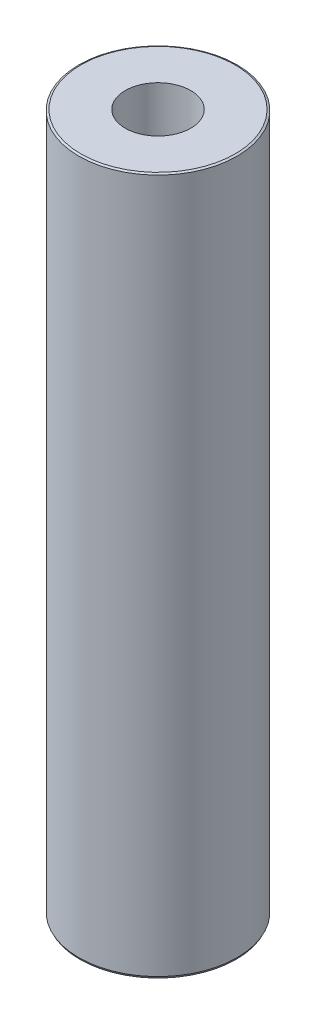
ISO-10303-21;
HEADER;
FILE_DESCRIPTION(('STEP AP214'),'2;1');
FILE_NAME('part.step','',(''),(''),'','','');
FILE_SCHEMA(('AUTOMOTIVE_DESIGN { 1 0 10303 214 1 1 1 1 }'));
ENDSEC;
DATA;
#1=APPLICATION_CONTEXT('core data for automotive mechanical design processes');
#2=APPLICATION_PROTOCOL_DEFINITION('international standard','automotive_design',2000,#1);
#3=PRODUCT_CONTEXT('',#1,'mechanical');
#4=PRODUCT('Part','Part','',(#3));
#5=PRODUCT_RELATED_PRODUCT_CATEGORY('part','',(#4));
#6=PRODUCT_DEFINITION_FORMATION('','',#4);
#7=PRODUCT_DEFINITION_CONTEXT('part definition',#1,'design');
#8=PRODUCT_DEFINITION('design','',#6,#7);
#9=PRODUCT_DEFINITION_SHAPE('','',#8);
#10=(LENGTH_UNIT() NAMED_UNIT(*) SI_UNIT(.MILLI.,.METRE.));
#11=(NAMED_UNIT(*) PLANE_ANGLE_UNIT() SI_UNIT($,.RADIAN.));
#12=(NAMED_UNIT(*) SI_UNIT($,.STERADIAN.) SOLID_ANGLE_UNIT());
#13=UNCERTAINTY_MEASURE_WITH_UNIT(LENGTH_MEASURE(1.E-05),#10,'distance_accuracy_value','');
#14=(GEOMETRIC_REPRESENTATION_CONTEXT(3) GLOBAL_UNCERTAINTY_ASSIGNED_CONTEXT((#13)) GLOBAL_UNIT_ASSIGNED_CONTEXT((#10,
#11,#12)) REPRESENTATION_CONTEXT('',''));
#15=CARTESIAN_POINT('',(0.,0.,0.));
#16=DIRECTION('',(0.,0.,1.));
#17=DIRECTION('',(1.,0.,0.));
#18=AXIS2_PLACEMENT_3D('',#15,#16,#17);
#19=CARTESIAN_POINT('',(0.,396.360686705342,0.));
#20=DIRECTION('',(0.,-1.,0.));
#21=DIRECTION('',(0.,0.,-1.));
#22=AXIS2_PLACEMENT_3D('',#19,#20,#21);
#23=CYLINDRICAL_SURFACE('',#22,45.);
#24=CARTESIAN_POINT('',(0.,395.807132410123,0.));
#25=DIRECTION('',(0.,1.,0.));
#26=DIRECTION('',(0.,0.,1.));
#27=AXIS2_PLACEMENT_3D('',#24,#25,#26);
#28=CIRCLE('',#27,45.);
#29=CARTESIAN_POINT('',(0.,395.807132410123,45.));
#30=VERTEX_POINT('',#29);
#31=EDGE_CURVE('E50',#30,#30,#28,.F.);
#32=ORIENTED_EDGE('',*,*,#31,.T.);
#33=EDGE_LOOP('',(#32));
#34=FACE_BOUND('',#33,.T.);
#35=CARTESIAN_POINT('',(0.,1.13423565675758,0.));
#36=DIRECTION('',(0.,1.,0.));
#37=DIRECTION('',(0.,0.,1.));
#38=AXIS2_PLACEMENT_3D('',#35,#36,#37);
#39=CIRCLE('',#38,45.);
#40=CARTESIAN_POINT('',(0.,1.13423565675758,45.));
#41=VERTEX_POINT('',#40);
#42=EDGE_CURVE('E51',#41,#41,#39,.T.);
#43=ORIENTED_EDGE('',*,*,#42,.T.);
#44=EDGE_LOOP('',(#43));
#45=FACE_BOUND('',#44,.T.);
#46=ADVANCED_FACE('F39',(#34,#45),#23,.T.);
#47=CARTESIAN_POINT('',(0.,396.360686705342,0.));
#48=DIRECTION('',(0.,1.,0.));
#49=DIRECTION('',(0.,0.,1.));
#50=AXIS2_PLACEMENT_3D('',#47,#48,#49);
#51=PLANE('',#50);
#52=CARTESIAN_POINT('',(0.,396.360686705342,0.));
#53=DIRECTION('',(0.,1.,0.));
#54=DIRECTION('',(0.,0.,1.));
#55=AXIS2_PLACEMENT_3D('',#52,#53,#54);
#56=CIRCLE('',#55,43.8657643432423);
#57=CARTESIAN_POINT('',(0.,396.360686705342,43.8657643432423));
#58=VERTEX_POINT('',#57);
#59=EDGE_CURVE('E54',#58,#58,#56,.T.);
#60=ORIENTED_EDGE('',*,*,#59,.T.);
#61=EDGE_LOOP('',(#60));
#62=FACE_BOUND('',#61,.T.);
#63=CARTESIAN_POINT('',(0.,396.360686705342,0.));
#64=DIRECTION('',(0.,1.,0.));
#65=DIRECTION('',(0.,0.,1.));
#66=AXIS2_PLACEMENT_3D('',#63,#64,#65);
#67=CIRCLE('',#66,18.6029027035076);
#68=CARTESIAN_POINT('',(0.,396.360686705342,18.6029027035076));
#69=VERTEX_POINT('',#68);
#70=EDGE_CURVE('E58',#69,#69,#67,.T.);
#71=ORIENTED_EDGE('',*,*,#70,.F.);
#72=EDGE_LOOP('',(#71));
#73=FACE_BOUND('',#72,.T.);
#74=ADVANCED_FACE('F69',(#62,#73),#51,.T.);
#75=CARTESIAN_POINT('',(0.,0.,0.));
#76=DIRECTION('',(0.,1.,0.));
#77=DIRECTION('',(0.,0.,1.));
#78=AXIS2_PLACEMENT_3D('',#75,#76,#77);
#79=PLANE('',#78);
#80=CARTESIAN_POINT('',(0.,0.,0.));
#81=DIRECTION('',(0.,1.,0.));
#82=DIRECTION('',(0.,0.,1.));
#83=AXIS2_PLACEMENT_3D('',#80,#81,#82);
#84=CIRCLE('',#83,44.4464457047809);
#85=CARTESIAN_POINT('',(0.,0.,44.4464457047809));
#86=VERTEX_POINT('',#85);
#87=EDGE_CURVE('E10',#86,#86,#84,.F.);
#88=ORIENTED_EDGE('',*,*,#87,.T.);
#89=EDGE_LOOP('',(#88));
#90=FACE_BOUND('',#89,.T.);
#91=CARTESIAN_POINT('',(0.,0.,0.));
#92=DIRECTION('',(0.,1.,0.));
#93=DIRECTION('',(0.,0.,1.));
#94=AXIS2_PLACEMENT_3D('',#91,#92,#93);
#95=CIRCLE('',#94,18.6029027035076);
#96=CARTESIAN_POINT('',(0.,0.,18.6029027035076));
#97=VERTEX_POINT('',#96);
#98=EDGE_CURVE('E63',#97,#97,#95,.T.);
#99=ORIENTED_EDGE('',*,*,#98,.T.);
#100=EDGE_LOOP('',(#99));
#101=FACE_BOUND('',#100,.T.);
#102=ADVANCED_FACE('F75',(#90,#101),#79,.F.);
#103=CARTESIAN_POINT('',(0.,396.360686705342,0.));
#104=DIRECTION('',(0.,-1.,0.));
#105=DIRECTION('',(0.,0.,-1.));
#106=AXIS2_PLACEMENT_3D('',#103,#104,#105);
#107=CYLINDRICAL_SURFACE('',#106,18.6029027035076);
#108=ORIENTED_EDGE('',*,*,#70,.T.);
#109=EDGE_LOOP('',(#108));
#110=FACE_BOUND('',#109,.T.);
#111=ORIENTED_EDGE('',*,*,#98,.F.);
#112=EDGE_LOOP('',(#111));
#113=FACE_BOUND('',#112,.T.);
#114=ADVANCED_FACE('F70',(#110,#113),#107,.F.);
#115=CARTESIAN_POINT('',(0.,396.360686705342,0.));
#116=DIRECTION('',(0.,-1.,0.));
#117=DIRECTION('',(0.,0.,-1.));
#118=AXIS2_PLACEMENT_3D('',#115,#116,#117);
#119=CONICAL_SURFACE('',#118,43.8657643432423,1.11676104404137);
#120=ORIENTED_EDGE('',*,*,#31,.F.);
#121=EDGE_LOOP('',(#120));
#122=FACE_BOUND('',#121,.T.);
#123=ORIENTED_EDGE('',*,*,#59,.F.);
#124=EDGE_LOOP('',(#123));
#125=FACE_BOUND('',#124,.T.);
#126=ADVANCED_FACE('F81',(#122,#125),#119,.T.);
#127=CARTESIAN_POINT('',(0.,1.13423565675758,0.));
#128=DIRECTION('',(0.,1.,0.));
#129=DIRECTION('',(0.,0.,1.));
#130=AXIS2_PLACEMENT_3D('',#127,#128,#129);
#131=CONICAL_SURFACE('',#130,45.,0.454035282753512);
#132=ORIENTED_EDGE('',*,*,#87,.F.);
#133=EDGE_LOOP('',(#132));
#134=FACE_BOUND('',#133,.T.);
#135=ORIENTED_EDGE('',*,*,#42,.F.);
#136=EDGE_LOOP('',(#135));
#137=FACE_BOUND('',#136,.T.);
#138=ADVANCED_FACE('F45',(#134,#137),#131,.T.);
#139=CLOSED_SHELL('',(#46,#74,#102,#114,#126,#138));
#140=MANIFOLD_SOLID_BREP('B2',#139);
#141=ADVANCED_BREP_SHAPE_REPRESENTATION('',(#18,#140),#14);
#142=SHAPE_DEFINITION_REPRESENTATION(#9,#141);
ENDSEC;
END-ISO-10303-21;
